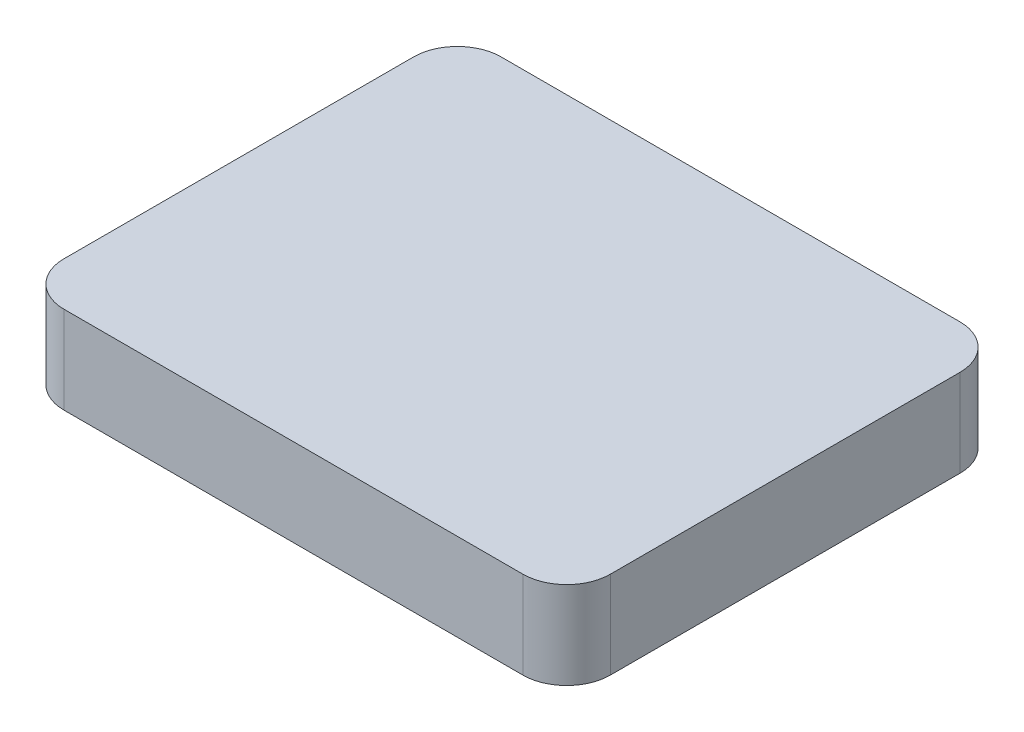
ISO-10303-21;
HEADER;
FILE_DESCRIPTION(('STEP AP214'),'2;1');
FILE_NAME('part.step','',(''),(''),'','','');
FILE_SCHEMA(('AUTOMOTIVE_DESIGN { 1 0 10303 214 1 1 1 1 }'));
ENDSEC;
DATA;
#1=APPLICATION_CONTEXT('core data for automotive mechanical design processes');
#2=APPLICATION_PROTOCOL_DEFINITION('international standard','automotive_design',2000,#1);
#3=PRODUCT_CONTEXT('',#1,'mechanical');
#4=PRODUCT('Part','Part','',(#3));
#5=PRODUCT_RELATED_PRODUCT_CATEGORY('part','',(#4));
#6=PRODUCT_DEFINITION_FORMATION('','',#4);
#7=PRODUCT_DEFINITION_CONTEXT('part definition',#1,'design');
#8=PRODUCT_DEFINITION('design','',#6,#7);
#9=PRODUCT_DEFINITION_SHAPE('','',#8);
#10=(LENGTH_UNIT() NAMED_UNIT(*) SI_UNIT(.MILLI.,.METRE.));
#11=(NAMED_UNIT(*) PLANE_ANGLE_UNIT() SI_UNIT($,.RADIAN.));
#12=(NAMED_UNIT(*) SI_UNIT($,.STERADIAN.) SOLID_ANGLE_UNIT());
#13=UNCERTAINTY_MEASURE_WITH_UNIT(LENGTH_MEASURE(1.E-05),#10,'distance_accuracy_value','');
#14=(GEOMETRIC_REPRESENTATION_CONTEXT(3) GLOBAL_UNCERTAINTY_ASSIGNED_CONTEXT((#13)) GLOBAL_UNIT_ASSIGNED_CONTEXT((#10,
#11,#12)) REPRESENTATION_CONTEXT('',''));
#15=CARTESIAN_POINT('',(0.,0.,0.));
#16=DIRECTION('',(0.,0.,1.));
#17=DIRECTION('',(1.,0.,0.));
#18=AXIS2_PLACEMENT_3D('',#15,#16,#17);
#19=CARTESIAN_POINT('',(125.,40.,-100.));
#20=DIRECTION('',(-1.,0.,0.));
#21=DIRECTION('',(0.,0.,1.));
#22=AXIS2_PLACEMENT_3D('',#19,#20,#21);
#23=PLANE('',#22);
#24=DIRECTION('',(0.,0.,-1.));
#25=VECTOR('',#24,1.);
#26=CARTESIAN_POINT('',(125.,0.,-100.));
#27=LINE('',#26,#25);
#28=CARTESIAN_POINT('',(125.,0.,80.));
#29=VERTEX_POINT('',#28);
#30=CARTESIAN_POINT('',(125.,0.,-80.));
#31=VERTEX_POINT('',#30);
#32=EDGE_CURVE('E182',#29,#31,#27,.T.);
#33=ORIENTED_EDGE('',*,*,#32,.T.);
#34=DIRECTION('',(0.,-1.,0.));
#35=VECTOR('',#34,1.);
#36=CARTESIAN_POINT('',(125.,40.,-80.));
#37=LINE('',#36,#35);
#38=CARTESIAN_POINT('',(125.,40.,-80.));
#39=VERTEX_POINT('',#38);
#40=EDGE_CURVE('E11',#31,#39,#37,.F.);
#41=ORIENTED_EDGE('',*,*,#40,.T.);
#42=DIRECTION('',(0.,0.,-1.));
#43=VECTOR('',#42,1.);
#44=CARTESIAN_POINT('',(125.,40.,-100.));
#45=LINE('',#44,#43);
#46=CARTESIAN_POINT('',(125.,40.,80.));
#47=VERTEX_POINT('',#46);
#48=EDGE_CURVE('E135',#47,#39,#45,.T.);
#49=ORIENTED_EDGE('',*,*,#48,.F.);
#50=DIRECTION('',(0.,-1.,0.));
#51=VECTOR('',#50,1.);
#52=CARTESIAN_POINT('',(125.,40.,80.));
#53=LINE('',#52,#51);
#54=EDGE_CURVE('E48',#47,#29,#53,.T.);
#55=ORIENTED_EDGE('',*,*,#54,.T.);
#56=EDGE_LOOP('',(#33,#41,#49,#55));
#57=FACE_BOUND('',#56,.T.);
#58=ADVANCED_FACE('F39',(#57),#23,.F.);
#59=CARTESIAN_POINT('',(-125.,40.,-100.));
#60=DIRECTION('',(0.,0.,1.));
#61=DIRECTION('',(1.,0.,0.));
#62=AXIS2_PLACEMENT_3D('',#59,#60,#61);
#63=PLANE('',#62);
#64=DIRECTION('',(-1.,0.,0.));
#65=VECTOR('',#64,1.);
#66=CARTESIAN_POINT('',(-125.,0.,-100.));
#67=LINE('',#66,#65);
#68=CARTESIAN_POINT('',(105.,0.,-100.));
#69=VERTEX_POINT('',#68);
#70=CARTESIAN_POINT('',(-105.,0.,-100.));
#71=VERTEX_POINT('',#70);
#72=EDGE_CURVE('E142',#69,#71,#67,.T.);
#73=ORIENTED_EDGE('',*,*,#72,.T.);
#74=DIRECTION('',(0.,-1.,0.));
#75=VECTOR('',#74,1.);
#76=CARTESIAN_POINT('',(-105.,40.,-100.));
#77=LINE('',#76,#75);
#78=CARTESIAN_POINT('',(-105.,40.,-100.));
#79=VERTEX_POINT('',#78);
#80=EDGE_CURVE('E55',#71,#79,#77,.F.);
#81=ORIENTED_EDGE('',*,*,#80,.T.);
#82=DIRECTION('',(-1.,0.,0.));
#83=VECTOR('',#82,1.);
#84=CARTESIAN_POINT('',(-125.,40.,-100.));
#85=LINE('',#84,#83);
#86=CARTESIAN_POINT('',(105.,40.,-100.));
#87=VERTEX_POINT('',#86);
#88=EDGE_CURVE('E140',#87,#79,#85,.T.);
#89=ORIENTED_EDGE('',*,*,#88,.F.);
#90=DIRECTION('',(0.,-1.,0.));
#91=VECTOR('',#90,1.);
#92=CARTESIAN_POINT('',(105.,40.,-100.));
#93=LINE('',#92,#91);
#94=EDGE_CURVE('E171',#87,#69,#93,.T.);
#95=ORIENTED_EDGE('',*,*,#94,.T.);
#96=EDGE_LOOP('',(#73,#81,#89,#95));
#97=FACE_BOUND('',#96,.T.);
#98=ADVANCED_FACE('F207',(#97),#63,.F.);
#99=CARTESIAN_POINT('',(-125.,40.,-100.));
#100=DIRECTION('',(1.,0.,0.));
#101=DIRECTION('',(0.,0.,-1.));
#102=AXIS2_PLACEMENT_3D('',#99,#100,#101);
#103=PLANE('',#102);
#104=DIRECTION('',(0.,0.,1.));
#105=VECTOR('',#104,1.);
#106=CARTESIAN_POINT('',(-125.,0.,-100.));
#107=LINE('',#106,#105);
#108=CARTESIAN_POINT('',(-125.,0.,-80.));
#109=VERTEX_POINT('',#108);
#110=CARTESIAN_POINT('',(-125.,0.,80.));
#111=VERTEX_POINT('',#110);
#112=EDGE_CURVE('E136',#109,#111,#107,.T.);
#113=ORIENTED_EDGE('',*,*,#112,.T.);
#114=DIRECTION('',(0.,-1.,0.));
#115=VECTOR('',#114,1.);
#116=CARTESIAN_POINT('',(-125.,40.,80.));
#117=LINE('',#116,#115);
#118=CARTESIAN_POINT('',(-125.,40.,80.));
#119=VERTEX_POINT('',#118);
#120=EDGE_CURVE('E111',#111,#119,#117,.F.);
#121=ORIENTED_EDGE('',*,*,#120,.T.);
#122=DIRECTION('',(0.,0.,1.));
#123=VECTOR('',#122,1.);
#124=CARTESIAN_POINT('',(-125.,40.,-100.));
#125=LINE('',#124,#123);
#126=CARTESIAN_POINT('',(-125.,40.,-80.));
#127=VERTEX_POINT('',#126);
#128=EDGE_CURVE('E193',#127,#119,#125,.T.);
#129=ORIENTED_EDGE('',*,*,#128,.F.);
#130=DIRECTION('',(0.,-1.,0.));
#131=VECTOR('',#130,1.);
#132=CARTESIAN_POINT('',(-125.,40.,-80.));
#133=LINE('',#132,#131);
#134=EDGE_CURVE('E117',#127,#109,#133,.T.);
#135=ORIENTED_EDGE('',*,*,#134,.T.);
#136=EDGE_LOOP('',(#113,#121,#129,#135));
#137=FACE_BOUND('',#136,.T.);
#138=ADVANCED_FACE('F206',(#137),#103,.F.);
#139=CARTESIAN_POINT('',(-125.,40.,100.));
#140=DIRECTION('',(0.,0.,-1.));
#141=DIRECTION('',(-1.,0.,0.));
#142=AXIS2_PLACEMENT_3D('',#139,#140,#141);
#143=PLANE('',#142);
#144=DIRECTION('',(1.,0.,0.));
#145=VECTOR('',#144,1.);
#146=CARTESIAN_POINT('',(-125.,40.,100.));
#147=LINE('',#146,#145);
#148=CARTESIAN_POINT('',(-105.,40.,100.));
#149=VERTEX_POINT('',#148);
#150=CARTESIAN_POINT('',(105.,40.,100.));
#151=VERTEX_POINT('',#150);
#152=EDGE_CURVE('E127',#149,#151,#147,.T.);
#153=ORIENTED_EDGE('',*,*,#152,.F.);
#154=DIRECTION('',(0.,-1.,0.));
#155=VECTOR('',#154,1.);
#156=CARTESIAN_POINT('',(-105.,40.,100.));
#157=LINE('',#156,#155);
#158=CARTESIAN_POINT('',(-105.,0.,100.));
#159=VERTEX_POINT('',#158);
#160=EDGE_CURVE('E110',#149,#159,#157,.T.);
#161=ORIENTED_EDGE('',*,*,#160,.T.);
#162=DIRECTION('',(1.,0.,0.));
#163=VECTOR('',#162,1.);
#164=CARTESIAN_POINT('',(-125.,0.,100.));
#165=LINE('',#164,#163);
#166=CARTESIAN_POINT('',(105.,0.,100.));
#167=VERTEX_POINT('',#166);
#168=EDGE_CURVE('E124',#159,#167,#165,.T.);
#169=ORIENTED_EDGE('',*,*,#168,.T.);
#170=DIRECTION('',(0.,-1.,0.));
#171=VECTOR('',#170,1.);
#172=CARTESIAN_POINT('',(105.,40.,100.));
#173=LINE('',#172,#171);
#174=EDGE_CURVE('E130',#167,#151,#173,.F.);
#175=ORIENTED_EDGE('',*,*,#174,.T.);
#176=EDGE_LOOP('',(#153,#161,#169,#175));
#177=FACE_BOUND('',#176,.T.);
#178=ADVANCED_FACE('F123',(#177),#143,.F.);
#179=CARTESIAN_POINT('',(0.,40.,0.));
#180=DIRECTION('',(0.,1.,0.));
#181=DIRECTION('',(0.,0.,1.));
#182=AXIS2_PLACEMENT_3D('',#179,#180,#181);
#183=PLANE('',#182);
#184=ORIENTED_EDGE('',*,*,#128,.T.);
#185=CARTESIAN_POINT('',(-105.,40.,80.));
#186=DIRECTION('',(0.,1.,0.));
#187=DIRECTION('',(0.,0.,1.));
#188=AXIS2_PLACEMENT_3D('',#185,#186,#187);
#189=CIRCLE('',#188,20.);
#190=EDGE_CURVE('E168',#119,#149,#189,.T.);
#191=ORIENTED_EDGE('',*,*,#190,.T.);
#192=ORIENTED_EDGE('',*,*,#152,.T.);
#193=CARTESIAN_POINT('',(105.,40.,80.));
#194=DIRECTION('',(0.,1.,0.));
#195=DIRECTION('',(0.,0.,1.));
#196=AXIS2_PLACEMENT_3D('',#193,#194,#195);
#197=CIRCLE('',#196,20.);
#198=EDGE_CURVE('E160',#151,#47,#197,.T.);
#199=ORIENTED_EDGE('',*,*,#198,.T.);
#200=ORIENTED_EDGE('',*,*,#48,.T.);
#201=CARTESIAN_POINT('',(105.,40.,-80.));
#202=DIRECTION('',(0.,1.,0.));
#203=DIRECTION('',(0.,0.,1.));
#204=AXIS2_PLACEMENT_3D('',#201,#202,#203);
#205=CIRCLE('',#204,20.);
#206=EDGE_CURVE('E62',#39,#87,#205,.T.);
#207=ORIENTED_EDGE('',*,*,#206,.T.);
#208=ORIENTED_EDGE('',*,*,#88,.T.);
#209=CARTESIAN_POINT('',(-105.,40.,-80.));
#210=DIRECTION('',(0.,1.,0.));
#211=DIRECTION('',(0.,0.,1.));
#212=AXIS2_PLACEMENT_3D('',#209,#210,#211);
#213=CIRCLE('',#212,20.);
#214=EDGE_CURVE('E165',#79,#127,#213,.T.);
#215=ORIENTED_EDGE('',*,*,#214,.T.);
#216=EDGE_LOOP('',(#184,#191,#192,#199,#200,#207,#208,#215));
#217=FACE_BOUND('',#216,.T.);
#218=ADVANCED_FACE('F199',(#217),#183,.T.);
#219=CARTESIAN_POINT('',(0.,0.,0.));
#220=DIRECTION('',(0.,1.,0.));
#221=DIRECTION('',(0.,0.,1.));
#222=AXIS2_PLACEMENT_3D('',#219,#220,#221);
#223=PLANE('',#222);
#224=ORIENTED_EDGE('',*,*,#168,.F.);
#225=CARTESIAN_POINT('',(-105.,0.,80.));
#226=DIRECTION('',(0.,1.,0.));
#227=DIRECTION('',(0.,0.,1.));
#228=AXIS2_PLACEMENT_3D('',#225,#226,#227);
#229=CIRCLE('',#228,20.);
#230=EDGE_CURVE('E106',#159,#111,#229,.F.);
#231=ORIENTED_EDGE('',*,*,#230,.T.);
#232=ORIENTED_EDGE('',*,*,#112,.F.);
#233=CARTESIAN_POINT('',(-105.,0.,-80.));
#234=DIRECTION('',(0.,1.,0.));
#235=DIRECTION('',(0.,0.,1.));
#236=AXIS2_PLACEMENT_3D('',#233,#234,#235);
#237=CIRCLE('',#236,20.);
#238=EDGE_CURVE('E118',#109,#71,#237,.F.);
#239=ORIENTED_EDGE('',*,*,#238,.T.);
#240=ORIENTED_EDGE('',*,*,#72,.F.);
#241=CARTESIAN_POINT('',(105.,0.,-80.));
#242=DIRECTION('',(0.,1.,0.));
#243=DIRECTION('',(0.,0.,1.));
#244=AXIS2_PLACEMENT_3D('',#241,#242,#243);
#245=CIRCLE('',#244,20.);
#246=EDGE_CURVE('E150',#69,#31,#245,.F.);
#247=ORIENTED_EDGE('',*,*,#246,.T.);
#248=ORIENTED_EDGE('',*,*,#32,.F.);
#249=CARTESIAN_POINT('',(105.,0.,80.));
#250=DIRECTION('',(0.,1.,0.));
#251=DIRECTION('',(0.,0.,1.));
#252=AXIS2_PLACEMENT_3D('',#249,#250,#251);
#253=CIRCLE('',#252,20.);
#254=EDGE_CURVE('E129',#29,#167,#253,.F.);
#255=ORIENTED_EDGE('',*,*,#254,.T.);
#256=EDGE_LOOP('',(#224,#231,#232,#239,#240,#247,#248,#255));
#257=FACE_BOUND('',#256,.T.);
#258=ADVANCED_FACE('F132',(#257),#223,.F.);
#259=CARTESIAN_POINT('',(-105.,40.,80.));
#260=DIRECTION('',(0.,-1.,0.));
#261=DIRECTION('',(0.,0.,-1.));
#262=AXIS2_PLACEMENT_3D('',#259,#260,#261);
#263=CYLINDRICAL_SURFACE('',#262,20.);
#264=ORIENTED_EDGE('',*,*,#190,.F.);
#265=ORIENTED_EDGE('',*,*,#120,.F.);
#266=ORIENTED_EDGE('',*,*,#230,.F.);
#267=ORIENTED_EDGE('',*,*,#160,.F.);
#268=EDGE_LOOP('',(#264,#265,#266,#267));
#269=FACE_BOUND('',#268,.T.);
#270=ADVANCED_FACE('F109',(#269),#263,.T.);
#271=CARTESIAN_POINT('',(-105.,40.,-80.));
#272=DIRECTION('',(0.,-1.,0.));
#273=DIRECTION('',(0.,0.,-1.));
#274=AXIS2_PLACEMENT_3D('',#271,#272,#273);
#275=CYLINDRICAL_SURFACE('',#274,20.);
#276=ORIENTED_EDGE('',*,*,#214,.F.);
#277=ORIENTED_EDGE('',*,*,#80,.F.);
#278=ORIENTED_EDGE('',*,*,#238,.F.);
#279=ORIENTED_EDGE('',*,*,#134,.F.);
#280=EDGE_LOOP('',(#276,#277,#278,#279));
#281=FACE_BOUND('',#280,.T.);
#282=ADVANCED_FACE('F204',(#281),#275,.T.);
#283=CARTESIAN_POINT('',(105.,40.,-80.));
#284=DIRECTION('',(0.,-1.,0.));
#285=DIRECTION('',(0.,0.,-1.));
#286=AXIS2_PLACEMENT_3D('',#283,#284,#285);
#287=CYLINDRICAL_SURFACE('',#286,20.);
#288=ORIENTED_EDGE('',*,*,#206,.F.);
#289=ORIENTED_EDGE('',*,*,#40,.F.);
#290=ORIENTED_EDGE('',*,*,#246,.F.);
#291=ORIENTED_EDGE('',*,*,#94,.F.);
#292=EDGE_LOOP('',(#288,#289,#290,#291));
#293=FACE_BOUND('',#292,.T.);
#294=ADVANCED_FACE('F209',(#293),#287,.T.);
#295=CARTESIAN_POINT('',(105.,40.,80.));
#296=DIRECTION('',(0.,-1.,0.));
#297=DIRECTION('',(0.,0.,-1.));
#298=AXIS2_PLACEMENT_3D('',#295,#296,#297);
#299=CYLINDRICAL_SURFACE('',#298,20.);
#300=ORIENTED_EDGE('',*,*,#198,.F.);
#301=ORIENTED_EDGE('',*,*,#174,.F.);
#302=ORIENTED_EDGE('',*,*,#254,.F.);
#303=ORIENTED_EDGE('',*,*,#54,.F.);
#304=EDGE_LOOP('',(#300,#301,#302,#303));
#305=FACE_BOUND('',#304,.T.);
#306=ADVANCED_FACE('F41',(#305),#299,.T.);
#307=CLOSED_SHELL('',(#58,#98,#138,#178,#218,#258,#270,#282,#294,#306));
#308=MANIFOLD_SOLID_BREP('B2',#307);
#309=ADVANCED_BREP_SHAPE_REPRESENTATION('',(#18,#308),#14);
#310=SHAPE_DEFINITION_REPRESENTATION(#9,#309);
ENDSEC;
END-ISO-10303-21;
